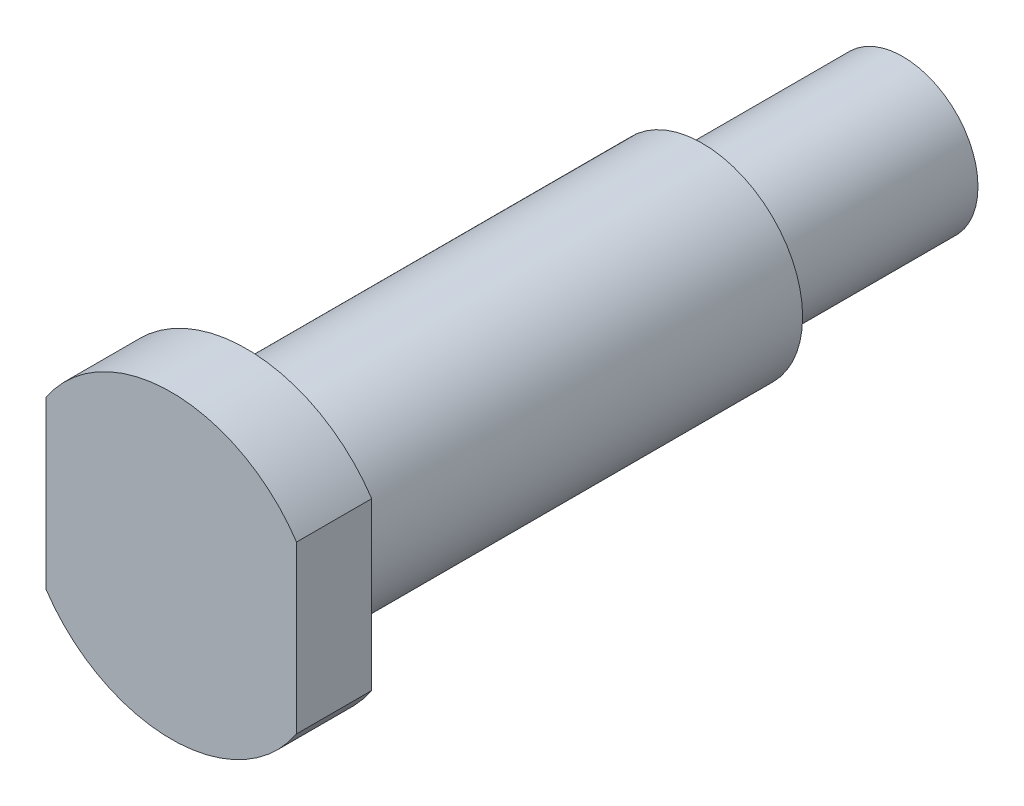
ISO-10303-21;
HEADER;
FILE_DESCRIPTION(('STEP AP214'),'2;1');
FILE_NAME('part.step','',(''),(''),'','','');
FILE_SCHEMA(('AUTOMOTIVE_DESIGN { 1 0 10303 214 1 1 1 1 }'));
ENDSEC;
DATA;
#1=APPLICATION_CONTEXT('core data for automotive mechanical design processes');
#2=APPLICATION_PROTOCOL_DEFINITION('international standard','automotive_design',2000,#1);
#3=PRODUCT_CONTEXT('',#1,'mechanical');
#4=PRODUCT('Part','Part','',(#3));
#5=PRODUCT_RELATED_PRODUCT_CATEGORY('part','',(#4));
#6=PRODUCT_DEFINITION_FORMATION('','',#4);
#7=PRODUCT_DEFINITION_CONTEXT('part definition',#1,'design');
#8=PRODUCT_DEFINITION('design','',#6,#7);
#9=PRODUCT_DEFINITION_SHAPE('','',#8);
#10=(LENGTH_UNIT() NAMED_UNIT(*) SI_UNIT(.MILLI.,.METRE.));
#11=(NAMED_UNIT(*) PLANE_ANGLE_UNIT() SI_UNIT($,.RADIAN.));
#12=(NAMED_UNIT(*) SI_UNIT($,.STERADIAN.) SOLID_ANGLE_UNIT());
#13=UNCERTAINTY_MEASURE_WITH_UNIT(LENGTH_MEASURE(1.E-05),#10,'distance_accuracy_value','');
#14=(GEOMETRIC_REPRESENTATION_CONTEXT(3) GLOBAL_UNCERTAINTY_ASSIGNED_CONTEXT((#13)) GLOBAL_UNIT_ASSIGNED_CONTEXT((#10,
#11,#12)) REPRESENTATION_CONTEXT('',''));
#15=CARTESIAN_POINT('',(0.,0.,0.));
#16=DIRECTION('',(0.,0.,1.));
#17=DIRECTION('',(1.,0.,0.));
#18=AXIS2_PLACEMENT_3D('',#15,#16,#17);
#19=CARTESIAN_POINT('',(0.,0.,0.));
#20=DIRECTION('',(0.,0.,-1.));
#21=DIRECTION('',(-1.,0.,0.));
#22=AXIS2_PLACEMENT_3D('',#19,#20,#21);
#23=PLANE('',#22);
#24=DIRECTION('',(0.,1.,0.));
#25=VECTOR('',#24,1.);
#26=CARTESIAN_POINT('',(5.,-7.4894593151835,0.));
#27=LINE('',#26,#25);
#28=CARTESIAN_POINT('',(5.,-3.3166247903554,0.));
#29=VERTEX_POINT('',#28);
#30=CARTESIAN_POINT('',(5.,3.3166247903554,0.));
#31=VERTEX_POINT('',#30);
#32=EDGE_CURVE('E82',#29,#31,#27,.T.);
#33=ORIENTED_EDGE('',*,*,#32,.T.);
#34=CARTESIAN_POINT('',(0.,0.,0.));
#35=DIRECTION('',(0.,0.,1.));
#36=DIRECTION('',(1.,0.,0.));
#37=AXIS2_PLACEMENT_3D('',#34,#35,#36);
#38=CIRCLE('',#37,6.);
#39=CARTESIAN_POINT('',(-5.,3.31662479035539,0.));
#40=VERTEX_POINT('',#39);
#41=EDGE_CURVE('E89',#31,#40,#38,.T.);
#42=ORIENTED_EDGE('',*,*,#41,.T.);
#43=DIRECTION('',(0.,-1.,0.));
#44=VECTOR('',#43,1.);
#45=CARTESIAN_POINT('',(-5.,-7.4894593151835,0.));
#46=LINE('',#45,#44);
#47=CARTESIAN_POINT('',(-5.,-3.3166247903554,0.));
#48=VERTEX_POINT('',#47);
#49=EDGE_CURVE('E74',#40,#48,#46,.T.);
#50=ORIENTED_EDGE('',*,*,#49,.T.);
#51=EDGE_CURVE('E94',#48,#29,#38,.T.);
#52=ORIENTED_EDGE('',*,*,#51,.T.);
#53=EDGE_LOOP('',(#33,#42,#50,#52));
#54=FACE_BOUND('',#53,.T.);
#55=ADVANCED_FACE('F37',(#54),#23,.F.);
#56=CARTESIAN_POINT('',(0.,0.,0.));
#57=DIRECTION('',(0.,0.,1.));
#58=DIRECTION('',(1.,0.,0.));
#59=AXIS2_PLACEMENT_3D('',#56,#57,#58);
#60=CYLINDRICAL_SURFACE('',#59,6.);
#61=DIRECTION('',(0.,0.,1.));
#62=VECTOR('',#61,1.);
#63=CARTESIAN_POINT('',(5.,3.3166247903554,0.));
#64=LINE('',#63,#62);
#65=CARTESIAN_POINT('',(5.,3.3166247903554,-3.));
#66=VERTEX_POINT('',#65);
#67=EDGE_CURVE('E111',#66,#31,#64,.T.);
#68=ORIENTED_EDGE('',*,*,#67,.F.);
#69=CARTESIAN_POINT('',(0.,0.,-3.));
#70=DIRECTION('',(0.,0.,1.));
#71=DIRECTION('',(1.,0.,0.));
#72=AXIS2_PLACEMENT_3D('',#69,#70,#71);
#73=CIRCLE('',#72,6.);
#74=CARTESIAN_POINT('',(-5.,3.3166247903554,-3.));
#75=VERTEX_POINT('',#74);
#76=EDGE_CURVE('E91',#66,#75,#73,.T.);
#77=ORIENTED_EDGE('',*,*,#76,.T.);
#78=DIRECTION('',(0.,0.,1.));
#79=VECTOR('',#78,1.);
#80=CARTESIAN_POINT('',(-5.,3.3166247903554,0.));
#81=LINE('',#80,#79);
#82=EDGE_CURVE('E58',#40,#75,#81,.F.);
#83=ORIENTED_EDGE('',*,*,#82,.F.);
#84=ORIENTED_EDGE('',*,*,#41,.F.);
#85=EDGE_LOOP('',(#68,#77,#83,#84));
#86=FACE_BOUND('',#85,.T.);
#87=ADVANCED_FACE('F88',(#86),#60,.T.);
#88=DIRECTION('',(0.,0.,1.));
#89=VECTOR('',#88,1.);
#90=CARTESIAN_POINT('',(5.,-3.3166247903554,0.));
#91=LINE('',#90,#89);
#92=CARTESIAN_POINT('',(5.,-3.3166247903554,-3.));
#93=VERTEX_POINT('',#92);
#94=EDGE_CURVE('E50',#29,#93,#91,.F.);
#95=ORIENTED_EDGE('',*,*,#94,.F.);
#96=ORIENTED_EDGE('',*,*,#51,.F.);
#97=DIRECTION('',(0.,0.,1.));
#98=VECTOR('',#97,1.);
#99=CARTESIAN_POINT('',(-5.,-3.3166247903554,0.));
#100=LINE('',#99,#98);
#101=CARTESIAN_POINT('',(-5.,-3.3166247903554,-3.));
#102=VERTEX_POINT('',#101);
#103=EDGE_CURVE('E77',#102,#48,#100,.T.);
#104=ORIENTED_EDGE('',*,*,#103,.F.);
#105=EDGE_CURVE('E98',#102,#93,#73,.T.);
#106=ORIENTED_EDGE('',*,*,#105,.T.);
#107=EDGE_LOOP('',(#95,#96,#104,#106));
#108=FACE_BOUND('',#107,.T.);
#109=ADVANCED_FACE('F121',(#108),#60,.T.);
#110=CARTESIAN_POINT('',(0.,6.,-3.));
#111=DIRECTION('',(0.,0.,1.));
#112=DIRECTION('',(1.,0.,0.));
#113=AXIS2_PLACEMENT_3D('',#110,#111,#112);
#114=PLANE('',#113);
#115=CARTESIAN_POINT('',(0.,0.,-3.));
#116=DIRECTION('',(0.,0.,1.));
#117=DIRECTION('',(1.,0.,0.));
#118=AXIS2_PLACEMENT_3D('',#115,#116,#117);
#119=CIRCLE('',#118,4.);
#120=CARTESIAN_POINT('',(4.,0.,-3.));
#121=VERTEX_POINT('',#120);
#122=EDGE_CURVE('E99',#121,#121,#119,.T.);
#123=ORIENTED_EDGE('',*,*,#122,.T.);
#124=EDGE_LOOP('',(#123));
#125=FACE_BOUND('',#124,.T.);
#126=DIRECTION('',(0.,1.,0.));
#127=VECTOR('',#126,1.);
#128=CARTESIAN_POINT('',(5.,6.,-3.));
#129=LINE('',#128,#127);
#130=EDGE_CURVE('E12',#93,#66,#129,.T.);
#131=ORIENTED_EDGE('',*,*,#130,.F.);
#132=ORIENTED_EDGE('',*,*,#105,.F.);
#133=DIRECTION('',(0.,-1.,0.));
#134=VECTOR('',#133,1.);
#135=CARTESIAN_POINT('',(-5.,6.,-3.));
#136=LINE('',#135,#134);
#137=EDGE_CURVE('E44',#75,#102,#136,.T.);
#138=ORIENTED_EDGE('',*,*,#137,.F.);
#139=ORIENTED_EDGE('',*,*,#76,.F.);
#140=EDGE_LOOP('',(#131,#132,#138,#139));
#141=FACE_BOUND('',#140,.T.);
#142=ADVANCED_FACE('F117',(#125,#141),#114,.F.);
#143=CARTESIAN_POINT('',(0.,0.,0.));
#144=DIRECTION('',(0.,0.,1.));
#145=DIRECTION('',(1.,0.,0.));
#146=AXIS2_PLACEMENT_3D('',#143,#144,#145);
#147=CYLINDRICAL_SURFACE('',#146,4.);
#148=ORIENTED_EDGE('',*,*,#122,.F.);
#149=EDGE_LOOP('',(#148));
#150=FACE_BOUND('',#149,.T.);
#151=CARTESIAN_POINT('',(0.,0.,-21.2));
#152=DIRECTION('',(0.,0.,1.));
#153=DIRECTION('',(1.,0.,0.));
#154=AXIS2_PLACEMENT_3D('',#151,#152,#153);
#155=CIRCLE('',#154,4.);
#156=CARTESIAN_POINT('',(4.,0.,-21.2));
#157=VERTEX_POINT('',#156);
#158=EDGE_CURVE('E102',#157,#157,#155,.T.);
#159=ORIENTED_EDGE('',*,*,#158,.T.);
#160=EDGE_LOOP('',(#159));
#161=FACE_BOUND('',#160,.T.);
#162=ADVANCED_FACE('F127',(#150,#161),#147,.T.);
#163=CARTESIAN_POINT('',(0.,4.,-21.2));
#164=DIRECTION('',(0.,0.,1.));
#165=DIRECTION('',(1.,0.,0.));
#166=AXIS2_PLACEMENT_3D('',#163,#164,#165);
#167=PLANE('',#166);
#168=ORIENTED_EDGE('',*,*,#158,.F.);
#169=EDGE_LOOP('',(#168));
#170=FACE_BOUND('',#169,.T.);
#171=CARTESIAN_POINT('',(0.,0.,-21.2));
#172=DIRECTION('',(0.,0.,1.));
#173=DIRECTION('',(1.,0.,0.));
#174=AXIS2_PLACEMENT_3D('',#171,#172,#173);
#175=CIRCLE('',#174,3.);
#176=CARTESIAN_POINT('',(3.,0.,-21.2));
#177=VERTEX_POINT('',#176);
#178=EDGE_CURVE('E105',#177,#177,#175,.T.);
#179=ORIENTED_EDGE('',*,*,#178,.T.);
#180=EDGE_LOOP('',(#179));
#181=FACE_BOUND('',#180,.T.);
#182=ADVANCED_FACE('F178',(#170,#181),#167,.F.);
#183=CARTESIAN_POINT('',(0.,0.,0.));
#184=DIRECTION('',(0.,0.,1.));
#185=DIRECTION('',(1.,0.,0.));
#186=AXIS2_PLACEMENT_3D('',#183,#184,#185);
#187=CYLINDRICAL_SURFACE('',#186,3.);
#188=ORIENTED_EDGE('',*,*,#178,.F.);
#189=EDGE_LOOP('',(#188));
#190=FACE_BOUND('',#189,.T.);
#191=CARTESIAN_POINT('',(0.,0.,-29.2));
#192=DIRECTION('',(0.,0.,1.));
#193=DIRECTION('',(1.,0.,0.));
#194=AXIS2_PLACEMENT_3D('',#191,#192,#193);
#195=CIRCLE('',#194,3.);
#196=CARTESIAN_POINT('',(3.,0.,-29.2));
#197=VERTEX_POINT('',#196);
#198=EDGE_CURVE('E108',#197,#197,#195,.T.);
#199=ORIENTED_EDGE('',*,*,#198,.T.);
#200=EDGE_LOOP('',(#199));
#201=FACE_BOUND('',#200,.T.);
#202=ADVANCED_FACE('F174',(#190,#201),#187,.T.);
#203=CARTESIAN_POINT('',(0.,3.,-29.2));
#204=DIRECTION('',(0.,0.,1.));
#205=DIRECTION('',(1.,0.,0.));
#206=AXIS2_PLACEMENT_3D('',#203,#204,#205);
#207=PLANE('',#206);
#208=ORIENTED_EDGE('',*,*,#198,.F.);
#209=EDGE_LOOP('',(#208));
#210=FACE_BOUND('',#209,.T.);
#211=ADVANCED_FACE('F159',(#210),#207,.F.);
#212=CARTESIAN_POINT('',(-5.,-7.4894593151835,-10.));
#213=DIRECTION('',(-1.,0.,0.));
#214=DIRECTION('',(0.,0.,1.));
#215=AXIS2_PLACEMENT_3D('',#212,#213,#214);
#216=PLANE('',#215);
#217=ORIENTED_EDGE('',*,*,#103,.T.);
#218=ORIENTED_EDGE('',*,*,#49,.F.);
#219=ORIENTED_EDGE('',*,*,#82,.T.);
#220=ORIENTED_EDGE('',*,*,#137,.T.);
#221=EDGE_LOOP('',(#217,#218,#219,#220));
#222=FACE_BOUND('',#221,.T.);
#223=ADVANCED_FACE('F75',(#222),#216,.T.);
#224=CARTESIAN_POINT('',(5.,-7.4894593151835,-10.));
#225=DIRECTION('',(1.,0.,0.));
#226=DIRECTION('',(0.,0.,-1.));
#227=AXIS2_PLACEMENT_3D('',#224,#225,#226);
#228=PLANE('',#227);
#229=ORIENTED_EDGE('',*,*,#67,.T.);
#230=ORIENTED_EDGE('',*,*,#32,.F.);
#231=ORIENTED_EDGE('',*,*,#94,.T.);
#232=ORIENTED_EDGE('',*,*,#130,.T.);
#233=EDGE_LOOP('',(#229,#230,#231,#232));
#234=FACE_BOUND('',#233,.T.);
#235=ADVANCED_FACE('F115',(#234),#228,.T.);
#236=CLOSED_SHELL('',(#55,#87,#109,#142,#162,#182,#202,#211,#223,#235));
#237=MANIFOLD_SOLID_BREP('B2',#236);
#238=ADVANCED_BREP_SHAPE_REPRESENTATION('',(#18,#237),#14);
#239=SHAPE_DEFINITION_REPRESENTATION(#9,#238);
ENDSEC;
END-ISO-10303-21;
